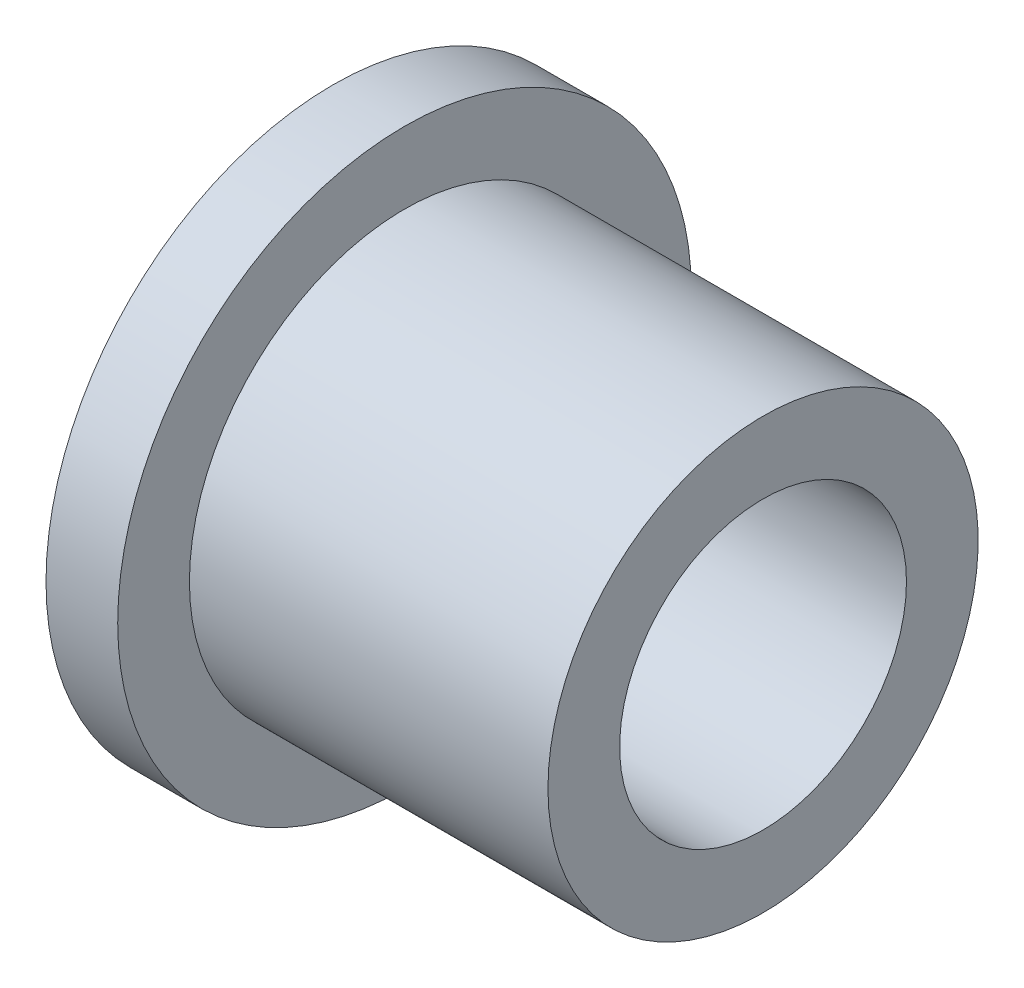
ISO-10303-21;
HEADER;
FILE_DESCRIPTION(('STEP AP214'),'2;1');
FILE_NAME('part.step','',(''),(''),'','','');
FILE_SCHEMA(('AUTOMOTIVE_DESIGN { 1 0 10303 214 1 1 1 1 }'));
ENDSEC;
DATA;
#1=APPLICATION_CONTEXT('core data for automotive mechanical design processes');
#2=APPLICATION_PROTOCOL_DEFINITION('international standard','automotive_design',2000,#1);
#3=PRODUCT_CONTEXT('',#1,'mechanical');
#4=PRODUCT('Part','Part','',(#3));
#5=PRODUCT_RELATED_PRODUCT_CATEGORY('part','',(#4));
#6=PRODUCT_DEFINITION_FORMATION('','',#4);
#7=PRODUCT_DEFINITION_CONTEXT('part definition',#1,'design');
#8=PRODUCT_DEFINITION('design','',#6,#7);
#9=PRODUCT_DEFINITION_SHAPE('','',#8);
#10=(LENGTH_UNIT() NAMED_UNIT(*) SI_UNIT(.MILLI.,.METRE.));
#11=(NAMED_UNIT(*) PLANE_ANGLE_UNIT() SI_UNIT($,.RADIAN.));
#12=(NAMED_UNIT(*) SI_UNIT($,.STERADIAN.) SOLID_ANGLE_UNIT());
#13=UNCERTAINTY_MEASURE_WITH_UNIT(LENGTH_MEASURE(1.E-05),#10,'distance_accuracy_value','');
#14=(GEOMETRIC_REPRESENTATION_CONTEXT(3) GLOBAL_UNCERTAINTY_ASSIGNED_CONTEXT((#13)) GLOBAL_UNIT_ASSIGNED_CONTEXT((#10,
#11,#12)) REPRESENTATION_CONTEXT('',''));
#15=CARTESIAN_POINT('',(0.,0.,0.));
#16=DIRECTION('',(0.,0.,1.));
#17=DIRECTION('',(1.,0.,0.));
#18=AXIS2_PLACEMENT_3D('',#15,#16,#17);
#19=CARTESIAN_POINT('',(0.,0.,0.));
#20=DIRECTION('',(1.,0.,0.));
#21=DIRECTION('',(0.,0.,-1.));
#22=AXIS2_PLACEMENT_3D('',#19,#20,#21);
#23=PLANE('',#22);
#24=CARTESIAN_POINT('',(0.,0.,0.));
#25=DIRECTION('',(1.,0.,0.));
#26=DIRECTION('',(0.,0.,-1.));
#27=AXIS2_PLACEMENT_3D('',#24,#25,#26);
#28=CIRCLE('',#27,3.175);
#29=CARTESIAN_POINT('',(0.,0.,-3.175));
#30=VERTEX_POINT('',#29);
#31=EDGE_CURVE('E48',#30,#30,#28,.T.);
#32=ORIENTED_EDGE('',*,*,#31,.T.);
#33=EDGE_LOOP('',(#32));
#34=FACE_BOUND('',#33,.T.);
#35=CARTESIAN_POINT('',(0.,0.,0.));
#36=DIRECTION('',(-1.,0.,0.));
#37=DIRECTION('',(0.,0.,1.));
#38=AXIS2_PLACEMENT_3D('',#35,#36,#37);
#39=CIRCLE('',#38,6.35);
#40=CARTESIAN_POINT('',(0.,0.,6.35));
#41=VERTEX_POINT('',#40);
#42=EDGE_CURVE('E10',#41,#41,#39,.T.);
#43=ORIENTED_EDGE('',*,*,#42,.T.);
#44=EDGE_LOOP('',(#43));
#45=FACE_BOUND('',#44,.T.);
#46=ADVANCED_FACE('F29',(#34,#45),#23,.F.);
#47=CARTESIAN_POINT('',(0.,0.,0.));
#48=DIRECTION('',(-1.,0.,0.));
#49=DIRECTION('',(0.,0.,1.));
#50=AXIS2_PLACEMENT_3D('',#47,#48,#49);
#51=CYLINDRICAL_SURFACE('',#50,6.35);
#52=ORIENTED_EDGE('',*,*,#42,.F.);
#53=EDGE_LOOP('',(#52));
#54=FACE_BOUND('',#53,.T.);
#55=CARTESIAN_POINT('',(1.5875,0.,0.));
#56=DIRECTION('',(-1.,0.,0.));
#57=DIRECTION('',(0.,0.,1.));
#58=AXIS2_PLACEMENT_3D('',#55,#56,#57);
#59=CIRCLE('',#58,6.35);
#60=CARTESIAN_POINT('',(1.5875,0.,6.35));
#61=VERTEX_POINT('',#60);
#62=EDGE_CURVE('E35',#61,#61,#59,.T.);
#63=ORIENTED_EDGE('',*,*,#62,.T.);
#64=EDGE_LOOP('',(#63));
#65=FACE_BOUND('',#64,.T.);
#66=ADVANCED_FACE('F76',(#54,#65),#51,.T.);
#67=CARTESIAN_POINT('',(1.5875,6.35,0.));
#68=DIRECTION('',(-1.,0.,0.));
#69=DIRECTION('',(0.,0.,1.));
#70=AXIS2_PLACEMENT_3D('',#67,#68,#69);
#71=PLANE('',#70);
#72=ORIENTED_EDGE('',*,*,#62,.F.);
#73=EDGE_LOOP('',(#72));
#74=FACE_BOUND('',#73,.T.);
#75=CARTESIAN_POINT('',(1.5875,0.,0.));
#76=DIRECTION('',(-1.,0.,0.));
#77=DIRECTION('',(0.,0.,1.));
#78=AXIS2_PLACEMENT_3D('',#75,#76,#77);
#79=CIRCLE('',#78,4.7625);
#80=CARTESIAN_POINT('',(1.5875,0.,4.7625));
#81=VERTEX_POINT('',#80);
#82=EDGE_CURVE('E39',#81,#81,#79,.T.);
#83=ORIENTED_EDGE('',*,*,#82,.T.);
#84=EDGE_LOOP('',(#83));
#85=FACE_BOUND('',#84,.T.);
#86=ADVANCED_FACE('F70',(#74,#85),#71,.F.);
#87=CARTESIAN_POINT('',(0.,0.,0.));
#88=DIRECTION('',(-1.,0.,0.));
#89=DIRECTION('',(0.,0.,1.));
#90=AXIS2_PLACEMENT_3D('',#87,#88,#89);
#91=CYLINDRICAL_SURFACE('',#90,4.7625);
#92=ORIENTED_EDGE('',*,*,#82,.F.);
#93=EDGE_LOOP('',(#92));
#94=FACE_BOUND('',#93,.T.);
#95=CARTESIAN_POINT('',(9.525,0.,0.));
#96=DIRECTION('',(-1.,0.,0.));
#97=DIRECTION('',(0.,0.,1.));
#98=AXIS2_PLACEMENT_3D('',#95,#96,#97);
#99=CIRCLE('',#98,4.7625);
#100=CARTESIAN_POINT('',(9.525,0.,4.7625));
#101=VERTEX_POINT('',#100);
#102=EDGE_CURVE('E43',#101,#101,#99,.T.);
#103=ORIENTED_EDGE('',*,*,#102,.T.);
#104=EDGE_LOOP('',(#103));
#105=FACE_BOUND('',#104,.T.);
#106=ADVANCED_FACE('F65',(#94,#105),#91,.T.);
#107=CARTESIAN_POINT('',(9.525,4.7625,0.));
#108=DIRECTION('',(-1.,0.,0.));
#109=DIRECTION('',(0.,0.,1.));
#110=AXIS2_PLACEMENT_3D('',#107,#108,#109);
#111=PLANE('',#110);
#112=CARTESIAN_POINT('',(9.525,0.,0.));
#113=DIRECTION('',(1.,0.,0.));
#114=DIRECTION('',(0.,0.,-1.));
#115=AXIS2_PLACEMENT_3D('',#112,#113,#114);
#116=CIRCLE('',#115,3.175);
#117=CARTESIAN_POINT('',(9.525,0.,-3.175));
#118=VERTEX_POINT('',#117);
#119=EDGE_CURVE('E49',#118,#118,#116,.T.);
#120=ORIENTED_EDGE('',*,*,#119,.F.);
#121=EDGE_LOOP('',(#120));
#122=FACE_BOUND('',#121,.T.);
#123=ORIENTED_EDGE('',*,*,#102,.F.);
#124=EDGE_LOOP('',(#123));
#125=FACE_BOUND('',#124,.T.);
#126=ADVANCED_FACE('F59',(#122,#125),#111,.F.);
#127=CARTESIAN_POINT('',(0.,0.,0.));
#128=DIRECTION('',(1.,0.,0.));
#129=DIRECTION('',(0.,0.,-1.));
#130=AXIS2_PLACEMENT_3D('',#127,#128,#129);
#131=CYLINDRICAL_SURFACE('',#130,3.175);
#132=ORIENTED_EDGE('',*,*,#31,.F.);
#133=EDGE_LOOP('',(#132));
#134=FACE_BOUND('',#133,.T.);
#135=ORIENTED_EDGE('',*,*,#119,.T.);
#136=EDGE_LOOP('',(#135));
#137=FACE_BOUND('',#136,.T.);
#138=ADVANCED_FACE('F56',(#134,#137),#131,.F.);
#139=CLOSED_SHELL('',(#46,#66,#86,#106,#126,#138));
#140=MANIFOLD_SOLID_BREP('B2',#139);
#141=ADVANCED_BREP_SHAPE_REPRESENTATION('',(#18,#140),#14);
#142=SHAPE_DEFINITION_REPRESENTATION(#9,#141);
ENDSEC;
END-ISO-10303-21;
